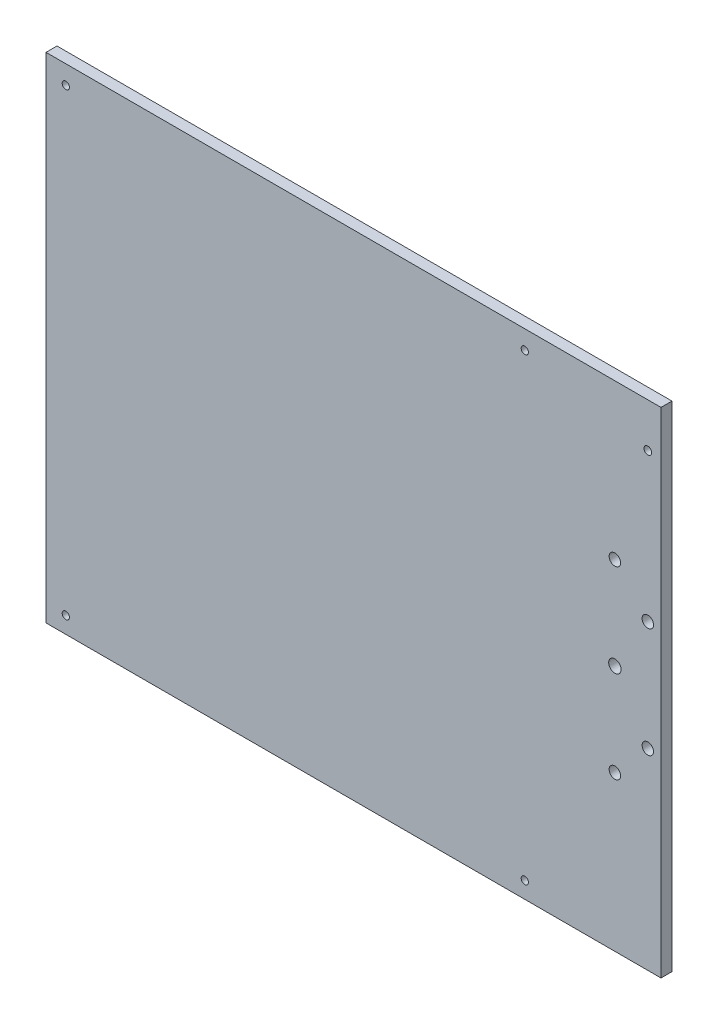
ISO-10303-21;
HEADER;
FILE_DESCRIPTION(('STEP AP214'),'2;1');
FILE_NAME('part.step','',(''),(''),'','','');
FILE_SCHEMA(('AUTOMOTIVE_DESIGN { 1 0 10303 214 1 1 1 1 }'));
ENDSEC;
DATA;
#1=APPLICATION_CONTEXT('core data for automotive mechanical design processes');
#2=APPLICATION_PROTOCOL_DEFINITION('international standard','automotive_design',2000,#1);
#3=PRODUCT_CONTEXT('',#1,'mechanical');
#4=PRODUCT('Part','Part','',(#3));
#5=PRODUCT_RELATED_PRODUCT_CATEGORY('part','',(#4));
#6=PRODUCT_DEFINITION_FORMATION('','',#4);
#7=PRODUCT_DEFINITION_CONTEXT('part definition',#1,'design');
#8=PRODUCT_DEFINITION('design','',#6,#7);
#9=PRODUCT_DEFINITION_SHAPE('','',#8);
#10=(LENGTH_UNIT() NAMED_UNIT(*) SI_UNIT(.MILLI.,.METRE.));
#11=(NAMED_UNIT(*) PLANE_ANGLE_UNIT() SI_UNIT($,.RADIAN.));
#12=(NAMED_UNIT(*) SI_UNIT($,.STERADIAN.) SOLID_ANGLE_UNIT());
#13=UNCERTAINTY_MEASURE_WITH_UNIT(LENGTH_MEASURE(1.E-05),#10,'distance_accuracy_value','');
#14=(GEOMETRIC_REPRESENTATION_CONTEXT(3) GLOBAL_UNCERTAINTY_ASSIGNED_CONTEXT((#13)) GLOBAL_UNIT_ASSIGNED_CONTEXT((#10,
#11,#12)) REPRESENTATION_CONTEXT('',''));
#15=CARTESIAN_POINT('',(0.,0.,0.));
#16=DIRECTION('',(0.,0.,1.));
#17=DIRECTION('',(1.,0.,0.));
#18=AXIS2_PLACEMENT_3D('',#15,#16,#17);
#19=CARTESIAN_POINT('',(0.,20.,5.));
#20=DIRECTION('',(-1.,0.,0.));
#21=DIRECTION('',(0.,0.,1.));
#22=AXIS2_PLACEMENT_3D('',#19,#20,#21);
#23=PLANE('',#22);
#24=DIRECTION('',(0.,1.,0.));
#25=VECTOR('',#24,1.);
#26=CARTESIAN_POINT('',(0.,20.,0.));
#27=LINE('',#26,#25);
#28=CARTESIAN_POINT('',(0.,20.,0.));
#29=VERTEX_POINT('',#28);
#30=CARTESIAN_POINT('',(0.,245.,0.));
#31=VERTEX_POINT('',#30);
#32=EDGE_CURVE('E97',#29,#31,#27,.T.);
#33=ORIENTED_EDGE('',*,*,#32,.T.);
#34=DIRECTION('',(0.,0.,-1.));
#35=VECTOR('',#34,1.);
#36=CARTESIAN_POINT('',(0.,245.,5.));
#37=LINE('',#36,#35);
#38=CARTESIAN_POINT('',(0.,245.,5.));
#39=VERTEX_POINT('',#38);
#40=EDGE_CURVE('E11',#39,#31,#37,.T.);
#41=ORIENTED_EDGE('',*,*,#40,.F.);
#42=DIRECTION('',(0.,1.,0.));
#43=VECTOR('',#42,1.);
#44=CARTESIAN_POINT('',(0.,20.,5.));
#45=LINE('',#44,#43);
#46=CARTESIAN_POINT('',(0.,20.,5.));
#47=VERTEX_POINT('',#46);
#48=EDGE_CURVE('E85',#47,#39,#45,.T.);
#49=ORIENTED_EDGE('',*,*,#48,.F.);
#50=DIRECTION('',(0.,0.,-1.));
#51=VECTOR('',#50,1.);
#52=CARTESIAN_POINT('',(0.,20.,5.));
#53=LINE('',#52,#51);
#54=EDGE_CURVE('E93',#47,#29,#53,.T.);
#55=ORIENTED_EDGE('',*,*,#54,.T.);
#56=EDGE_LOOP('',(#33,#41,#49,#55));
#57=FACE_BOUND('',#56,.T.);
#58=ADVANCED_FACE('F34',(#57),#23,.F.);
#59=CARTESIAN_POINT('',(0.,245.,5.));
#60=DIRECTION('',(0.,-1.,0.));
#61=DIRECTION('',(1.,0.,0.));
#62=AXIS2_PLACEMENT_3D('',#59,#60,#61);
#63=PLANE('',#62);
#64=DIRECTION('',(-1.,0.,0.));
#65=VECTOR('',#64,1.);
#66=CARTESIAN_POINT('',(0.,245.,0.));
#67=LINE('',#66,#65);
#68=CARTESIAN_POINT('',(-280.,245.,0.));
#69=VERTEX_POINT('',#68);
#70=EDGE_CURVE('E89',#31,#69,#67,.T.);
#71=ORIENTED_EDGE('',*,*,#70,.T.);
#72=DIRECTION('',(0.,0.,-1.));
#73=VECTOR('',#72,1.);
#74=CARTESIAN_POINT('',(-280.,245.,5.));
#75=LINE('',#74,#73);
#76=CARTESIAN_POINT('',(-280.,245.,5.));
#77=VERTEX_POINT('',#76);
#78=EDGE_CURVE('E42',#77,#69,#75,.T.);
#79=ORIENTED_EDGE('',*,*,#78,.F.);
#80=DIRECTION('',(-1.,0.,0.));
#81=VECTOR('',#80,1.);
#82=CARTESIAN_POINT('',(0.,245.,5.));
#83=LINE('',#82,#81);
#84=EDGE_CURVE('E80',#39,#77,#83,.T.);
#85=ORIENTED_EDGE('',*,*,#84,.F.);
#86=ORIENTED_EDGE('',*,*,#40,.T.);
#87=EDGE_LOOP('',(#71,#79,#85,#86));
#88=FACE_BOUND('',#87,.T.);
#89=ADVANCED_FACE('F88',(#88),#63,.F.);
#90=CARTESIAN_POINT('',(-280.,20.,5.));
#91=DIRECTION('',(1.,0.,0.));
#92=DIRECTION('',(0.,0.,-1.));
#93=AXIS2_PLACEMENT_3D('',#90,#91,#92);
#94=PLANE('',#93);
#95=DIRECTION('',(0.,-1.,0.));
#96=VECTOR('',#95,1.);
#97=CARTESIAN_POINT('',(-280.,20.,0.));
#98=LINE('',#97,#96);
#99=CARTESIAN_POINT('',(-280.,20.,0.));
#100=VERTEX_POINT('',#99);
#101=EDGE_CURVE('E67',#69,#100,#98,.T.);
#102=ORIENTED_EDGE('',*,*,#101,.T.);
#103=DIRECTION('',(0.,0.,-1.));
#104=VECTOR('',#103,1.);
#105=CARTESIAN_POINT('',(-280.,20.,5.));
#106=LINE('',#105,#104);
#107=CARTESIAN_POINT('',(-280.,20.,5.));
#108=VERTEX_POINT('',#107);
#109=EDGE_CURVE('E90',#108,#100,#106,.T.);
#110=ORIENTED_EDGE('',*,*,#109,.F.);
#111=DIRECTION('',(0.,-1.,0.));
#112=VECTOR('',#111,1.);
#113=CARTESIAN_POINT('',(-280.,20.,5.));
#114=LINE('',#113,#112);
#115=EDGE_CURVE('E83',#77,#108,#114,.T.);
#116=ORIENTED_EDGE('',*,*,#115,.F.);
#117=ORIENTED_EDGE('',*,*,#78,.T.);
#118=EDGE_LOOP('',(#102,#110,#116,#117));
#119=FACE_BOUND('',#118,.T.);
#120=ADVANCED_FACE('F91',(#119),#94,.F.);
#121=CARTESIAN_POINT('',(0.,20.,5.));
#122=DIRECTION('',(0.,1.,0.));
#123=DIRECTION('',(-1.,0.,0.));
#124=AXIS2_PLACEMENT_3D('',#121,#122,#123);
#125=PLANE('',#124);
#126=DIRECTION('',(1.,0.,0.));
#127=VECTOR('',#126,1.);
#128=CARTESIAN_POINT('',(0.,20.,0.));
#129=LINE('',#128,#127);
#130=EDGE_CURVE('E73',#100,#29,#129,.T.);
#131=ORIENTED_EDGE('',*,*,#130,.T.);
#132=ORIENTED_EDGE('',*,*,#54,.F.);
#133=DIRECTION('',(1.,0.,0.));
#134=VECTOR('',#133,1.);
#135=CARTESIAN_POINT('',(0.,20.,5.));
#136=LINE('',#135,#134);
#137=EDGE_CURVE('E50',#108,#47,#136,.T.);
#138=ORIENTED_EDGE('',*,*,#137,.F.);
#139=ORIENTED_EDGE('',*,*,#109,.T.);
#140=EDGE_LOOP('',(#131,#132,#138,#139));
#141=FACE_BOUND('',#140,.T.);
#142=ADVANCED_FACE('F105',(#141),#125,.F.);
#143=CARTESIAN_POINT('',(0.,0.,5.));
#144=DIRECTION('',(0.,0.,1.));
#145=DIRECTION('',(1.,0.,0.));
#146=AXIS2_PLACEMENT_3D('',#143,#144,#145);
#147=PLANE('',#146);
#148=CARTESIAN_POINT('',(-6.,225.,5.));
#149=DIRECTION('',(0.,0.,1.));
#150=DIRECTION('',(1.,0.,0.));
#151=AXIS2_PLACEMENT_3D('',#148,#149,#150);
#152=CIRCLE('',#151,1.75);
#153=CARTESIAN_POINT('',(-4.25,225.,5.));
#154=VERTEX_POINT('',#153);
#155=EDGE_CURVE('E164',#154,#154,#152,.T.);
#156=ORIENTED_EDGE('',*,*,#155,.F.);
#157=EDGE_LOOP('',(#156));
#158=FACE_BOUND('',#157,.T.);
#159=CARTESIAN_POINT('',(-21.,174.5,5.));
#160=DIRECTION('',(0.,0.,1.));
#161=DIRECTION('',(1.,0.,0.));
#162=AXIS2_PLACEMENT_3D('',#159,#160,#161);
#163=CIRCLE('',#162,2.6);
#164=CARTESIAN_POINT('',(-18.4,174.5,5.));
#165=VERTEX_POINT('',#164);
#166=EDGE_CURVE('E158',#165,#165,#163,.T.);
#167=ORIENTED_EDGE('',*,*,#166,.F.);
#168=EDGE_LOOP('',(#167));
#169=FACE_BOUND('',#168,.T.);
#170=CARTESIAN_POINT('',(-21.,132.5,5.));
#171=DIRECTION('',(0.,0.,1.));
#172=DIRECTION('',(1.,0.,0.));
#173=AXIS2_PLACEMENT_3D('',#170,#171,#172);
#174=CIRCLE('',#173,2.83064044469154);
#175=CARTESIAN_POINT('',(-18.1693595553085,132.5,5.));
#176=VERTEX_POINT('',#175);
#177=EDGE_CURVE('E152',#176,#176,#174,.T.);
#178=ORIENTED_EDGE('',*,*,#177,.F.);
#179=EDGE_LOOP('',(#178));
#180=FACE_BOUND('',#179,.T.);
#181=CARTESIAN_POINT('',(-21.,90.5,5.));
#182=DIRECTION('',(0.,0.,1.));
#183=DIRECTION('',(1.,0.,0.));
#184=AXIS2_PLACEMENT_3D('',#181,#182,#183);
#185=CIRCLE('',#184,2.60000000000001);
#186=CARTESIAN_POINT('',(-18.4,90.5,5.));
#187=VERTEX_POINT('',#186);
#188=EDGE_CURVE('E146',#187,#187,#185,.T.);
#189=ORIENTED_EDGE('',*,*,#188,.F.);
#190=EDGE_LOOP('',(#189));
#191=FACE_BOUND('',#190,.T.);
#192=CARTESIAN_POINT('',(-6.,157.5,5.));
#193=DIRECTION('',(0.,0.,1.));
#194=DIRECTION('',(1.,0.,0.));
#195=AXIS2_PLACEMENT_3D('',#192,#193,#194);
#196=CIRCLE('',#195,2.59999999999999);
#197=CARTESIAN_POINT('',(-3.40000000000001,157.5,5.));
#198=VERTEX_POINT('',#197);
#199=EDGE_CURVE('E140',#198,#198,#196,.T.);
#200=ORIENTED_EDGE('',*,*,#199,.F.);
#201=EDGE_LOOP('',(#200));
#202=FACE_BOUND('',#201,.T.);
#203=CARTESIAN_POINT('',(-6.,107.5,5.));
#204=DIRECTION('',(0.,0.,1.));
#205=DIRECTION('',(1.,0.,0.));
#206=AXIS2_PLACEMENT_3D('',#203,#204,#205);
#207=CIRCLE('',#206,2.6);
#208=CARTESIAN_POINT('',(-3.4,107.5,5.));
#209=VERTEX_POINT('',#208);
#210=EDGE_CURVE('E134',#209,#209,#207,.T.);
#211=ORIENTED_EDGE('',*,*,#210,.F.);
#212=EDGE_LOOP('',(#211));
#213=FACE_BOUND('',#212,.T.);
#214=CARTESIAN_POINT('',(-271.,27.5000000000032,5.));
#215=DIRECTION('',(0.,0.,1.));
#216=DIRECTION('',(1.,0.,0.));
#217=AXIS2_PLACEMENT_3D('',#214,#215,#216);
#218=CIRCLE('',#217,1.64999999999998);
#219=CARTESIAN_POINT('',(-269.35,27.5000000000032,5.));
#220=VERTEX_POINT('',#219);
#221=EDGE_CURVE('E128',#220,#220,#218,.T.);
#222=ORIENTED_EDGE('',*,*,#221,.F.);
#223=EDGE_LOOP('',(#222));
#224=FACE_BOUND('',#223,.T.);
#225=CARTESIAN_POINT('',(-62.,27.5000000000032,5.));
#226=DIRECTION('',(0.,0.,1.));
#227=DIRECTION('',(1.,0.,0.));
#228=AXIS2_PLACEMENT_3D('',#225,#226,#227);
#229=CIRCLE('',#228,1.64999999999999);
#230=CARTESIAN_POINT('',(-60.35,27.5000000000032,5.));
#231=VERTEX_POINT('',#230);
#232=EDGE_CURVE('E122',#231,#231,#229,.T.);
#233=ORIENTED_EDGE('',*,*,#232,.F.);
#234=EDGE_LOOP('',(#233));
#235=FACE_BOUND('',#234,.T.);
#236=CARTESIAN_POINT('',(-271.,236.500000000003,5.));
#237=DIRECTION('',(0.,0.,1.));
#238=DIRECTION('',(1.,0.,0.));
#239=AXIS2_PLACEMENT_3D('',#236,#237,#238);
#240=CIRCLE('',#239,1.64999999999998);
#241=CARTESIAN_POINT('',(-269.35,236.500000000003,5.));
#242=VERTEX_POINT('',#241);
#243=EDGE_CURVE('E116',#242,#242,#240,.T.);
#244=ORIENTED_EDGE('',*,*,#243,.F.);
#245=EDGE_LOOP('',(#244));
#246=FACE_BOUND('',#245,.T.);
#247=CARTESIAN_POINT('',(-62.,236.500000000003,5.));
#248=DIRECTION('',(0.,0.,1.));
#249=DIRECTION('',(1.,0.,0.));
#250=AXIS2_PLACEMENT_3D('',#247,#248,#249);
#251=CIRCLE('',#250,1.64999999999999);
#252=CARTESIAN_POINT('',(-60.35,236.500000000003,5.));
#253=VERTEX_POINT('',#252);
#254=EDGE_CURVE('E100',#253,#253,#251,.T.);
#255=ORIENTED_EDGE('',*,*,#254,.F.);
#256=EDGE_LOOP('',(#255));
#257=FACE_BOUND('',#256,.T.);
#258=ORIENTED_EDGE('',*,*,#48,.T.);
#259=ORIENTED_EDGE('',*,*,#84,.T.);
#260=ORIENTED_EDGE('',*,*,#115,.T.);
#261=ORIENTED_EDGE('',*,*,#137,.T.);
#262=EDGE_LOOP('',(#258,#259,#260,#261));
#263=FACE_BOUND('',#262,.T.);
#264=ADVANCED_FACE('F81',(#158,#169,#180,#191,#202,#213,#224,#235,#246,#257,#263),#147,.T.);
#265=CARTESIAN_POINT('',(0.,0.,0.));
#266=DIRECTION('',(0.,0.,1.));
#267=DIRECTION('',(1.,0.,0.));
#268=AXIS2_PLACEMENT_3D('',#265,#266,#267);
#269=PLANE('',#268);
#270=CARTESIAN_POINT('',(-6.,225.,0.));
#271=DIRECTION('',(0.,0.,-1.));
#272=DIRECTION('',(-1.,0.,0.));
#273=AXIS2_PLACEMENT_3D('',#270,#271,#272);
#274=CIRCLE('',#273,1.75);
#275=CARTESIAN_POINT('',(-7.75,225.,0.));
#276=VERTEX_POINT('',#275);
#277=EDGE_CURVE('E167',#276,#276,#274,.T.);
#278=ORIENTED_EDGE('',*,*,#277,.F.);
#279=EDGE_LOOP('',(#278));
#280=FACE_BOUND('',#279,.T.);
#281=CARTESIAN_POINT('',(-21.,174.5,0.));
#282=DIRECTION('',(0.,0.,-1.));
#283=DIRECTION('',(-1.,0.,0.));
#284=AXIS2_PLACEMENT_3D('',#281,#282,#283);
#285=CIRCLE('',#284,2.6);
#286=CARTESIAN_POINT('',(-23.6,174.5,0.));
#287=VERTEX_POINT('',#286);
#288=EDGE_CURVE('E161',#287,#287,#285,.T.);
#289=ORIENTED_EDGE('',*,*,#288,.F.);
#290=EDGE_LOOP('',(#289));
#291=FACE_BOUND('',#290,.T.);
#292=CARTESIAN_POINT('',(-21.,132.5,0.));
#293=DIRECTION('',(0.,0.,-1.));
#294=DIRECTION('',(-1.,0.,0.));
#295=AXIS2_PLACEMENT_3D('',#292,#293,#294);
#296=CIRCLE('',#295,2.83064044469154);
#297=CARTESIAN_POINT('',(-23.8306404446915,132.5,0.));
#298=VERTEX_POINT('',#297);
#299=EDGE_CURVE('E155',#298,#298,#296,.T.);
#300=ORIENTED_EDGE('',*,*,#299,.F.);
#301=EDGE_LOOP('',(#300));
#302=FACE_BOUND('',#301,.T.);
#303=CARTESIAN_POINT('',(-21.,90.5,0.));
#304=DIRECTION('',(0.,0.,-1.));
#305=DIRECTION('',(-1.,0.,0.));
#306=AXIS2_PLACEMENT_3D('',#303,#304,#305);
#307=CIRCLE('',#306,2.60000000000001);
#308=CARTESIAN_POINT('',(-23.6,90.5,0.));
#309=VERTEX_POINT('',#308);
#310=EDGE_CURVE('E149',#309,#309,#307,.T.);
#311=ORIENTED_EDGE('',*,*,#310,.F.);
#312=EDGE_LOOP('',(#311));
#313=FACE_BOUND('',#312,.T.);
#314=CARTESIAN_POINT('',(-6.,157.5,0.));
#315=DIRECTION('',(0.,0.,-1.));
#316=DIRECTION('',(-1.,0.,0.));
#317=AXIS2_PLACEMENT_3D('',#314,#315,#316);
#318=CIRCLE('',#317,2.59999999999999);
#319=CARTESIAN_POINT('',(-8.59999999999999,157.5,0.));
#320=VERTEX_POINT('',#319);
#321=EDGE_CURVE('E143',#320,#320,#318,.T.);
#322=ORIENTED_EDGE('',*,*,#321,.F.);
#323=EDGE_LOOP('',(#322));
#324=FACE_BOUND('',#323,.T.);
#325=CARTESIAN_POINT('',(-6.,107.5,0.));
#326=DIRECTION('',(0.,0.,-1.));
#327=DIRECTION('',(-1.,0.,0.));
#328=AXIS2_PLACEMENT_3D('',#325,#326,#327);
#329=CIRCLE('',#328,2.6);
#330=CARTESIAN_POINT('',(-8.6,107.5,0.));
#331=VERTEX_POINT('',#330);
#332=EDGE_CURVE('E137',#331,#331,#329,.T.);
#333=ORIENTED_EDGE('',*,*,#332,.F.);
#334=EDGE_LOOP('',(#333));
#335=FACE_BOUND('',#334,.T.);
#336=CARTESIAN_POINT('',(-271.,27.5000000000032,0.));
#337=DIRECTION('',(0.,0.,-1.));
#338=DIRECTION('',(-1.,0.,0.));
#339=AXIS2_PLACEMENT_3D('',#336,#337,#338);
#340=CIRCLE('',#339,1.64999999999998);
#341=CARTESIAN_POINT('',(-272.65,27.5000000000032,0.));
#342=VERTEX_POINT('',#341);
#343=EDGE_CURVE('E131',#342,#342,#340,.T.);
#344=ORIENTED_EDGE('',*,*,#343,.F.);
#345=EDGE_LOOP('',(#344));
#346=FACE_BOUND('',#345,.T.);
#347=CARTESIAN_POINT('',(-62.,27.5000000000032,0.));
#348=DIRECTION('',(0.,0.,-1.));
#349=DIRECTION('',(-1.,0.,0.));
#350=AXIS2_PLACEMENT_3D('',#347,#348,#349);
#351=CIRCLE('',#350,1.64999999999998);
#352=CARTESIAN_POINT('',(-63.65,27.5000000000032,0.));
#353=VERTEX_POINT('',#352);
#354=EDGE_CURVE('E125',#353,#353,#351,.T.);
#355=ORIENTED_EDGE('',*,*,#354,.F.);
#356=EDGE_LOOP('',(#355));
#357=FACE_BOUND('',#356,.T.);
#358=CARTESIAN_POINT('',(-271.,236.500000000003,0.));
#359=DIRECTION('',(0.,0.,-1.));
#360=DIRECTION('',(-1.,0.,0.));
#361=AXIS2_PLACEMENT_3D('',#358,#359,#360);
#362=CIRCLE('',#361,1.64999999999998);
#363=CARTESIAN_POINT('',(-272.65,236.500000000003,0.));
#364=VERTEX_POINT('',#363);
#365=EDGE_CURVE('E119',#364,#364,#362,.T.);
#366=ORIENTED_EDGE('',*,*,#365,.F.);
#367=EDGE_LOOP('',(#366));
#368=FACE_BOUND('',#367,.T.);
#369=CARTESIAN_POINT('',(-62.,236.500000000003,0.));
#370=DIRECTION('',(0.,0.,-1.));
#371=DIRECTION('',(-1.,0.,0.));
#372=AXIS2_PLACEMENT_3D('',#369,#370,#371);
#373=CIRCLE('',#372,1.64999999999998);
#374=CARTESIAN_POINT('',(-63.65,236.500000000003,0.));
#375=VERTEX_POINT('',#374);
#376=EDGE_CURVE('E113',#375,#375,#373,.T.);
#377=ORIENTED_EDGE('',*,*,#376,.F.);
#378=EDGE_LOOP('',(#377));
#379=FACE_BOUND('',#378,.T.);
#380=ORIENTED_EDGE('',*,*,#32,.F.);
#381=ORIENTED_EDGE('',*,*,#130,.F.);
#382=ORIENTED_EDGE('',*,*,#101,.F.);
#383=ORIENTED_EDGE('',*,*,#70,.F.);
#384=EDGE_LOOP('',(#380,#381,#382,#383));
#385=FACE_BOUND('',#384,.T.);
#386=ADVANCED_FACE('F108',(#280,#291,#302,#313,#324,#335,#346,#357,#368,#379,#385),#269,.F.);
#387=CARTESIAN_POINT('',(-62.,236.500000000003,0.));
#388=DIRECTION('',(0.,0.,-1.));
#389=DIRECTION('',(-1.,0.,0.));
#390=AXIS2_PLACEMENT_3D('',#387,#388,#389);
#391=CYLINDRICAL_SURFACE('',#390,1.64999999999999);
#392=ORIENTED_EDGE('',*,*,#376,.T.);
#393=EDGE_LOOP('',(#392));
#394=FACE_BOUND('',#393,.T.);
#395=ORIENTED_EDGE('',*,*,#254,.T.);
#396=EDGE_LOOP('',(#395));
#397=FACE_BOUND('',#396,.T.);
#398=ADVANCED_FACE('F175',(#394,#397),#391,.F.);
#399=CARTESIAN_POINT('',(-271.,236.500000000003,0.));
#400=DIRECTION('',(0.,0.,-1.));
#401=DIRECTION('',(-1.,0.,0.));
#402=AXIS2_PLACEMENT_3D('',#399,#400,#401);
#403=CYLINDRICAL_SURFACE('',#402,1.64999999999998);
#404=ORIENTED_EDGE('',*,*,#365,.T.);
#405=EDGE_LOOP('',(#404));
#406=FACE_BOUND('',#405,.T.);
#407=ORIENTED_EDGE('',*,*,#243,.T.);
#408=EDGE_LOOP('',(#407));
#409=FACE_BOUND('',#408,.T.);
#410=ADVANCED_FACE('F197',(#406,#409),#403,.F.);
#411=CARTESIAN_POINT('',(-62.,27.5000000000032,0.));
#412=DIRECTION('',(0.,0.,-1.));
#413=DIRECTION('',(-1.,0.,0.));
#414=AXIS2_PLACEMENT_3D('',#411,#412,#413);
#415=CYLINDRICAL_SURFACE('',#414,1.64999999999999);
#416=ORIENTED_EDGE('',*,*,#354,.T.);
#417=EDGE_LOOP('',(#416));
#418=FACE_BOUND('',#417,.T.);
#419=ORIENTED_EDGE('',*,*,#232,.T.);
#420=EDGE_LOOP('',(#419));
#421=FACE_BOUND('',#420,.T.);
#422=ADVANCED_FACE('F243',(#418,#421),#415,.F.);
#423=CARTESIAN_POINT('',(-271.,27.5000000000032,0.));
#424=DIRECTION('',(0.,0.,-1.));
#425=DIRECTION('',(-1.,0.,0.));
#426=AXIS2_PLACEMENT_3D('',#423,#424,#425);
#427=CYLINDRICAL_SURFACE('',#426,1.64999999999998);
#428=ORIENTED_EDGE('',*,*,#343,.T.);
#429=EDGE_LOOP('',(#428));
#430=FACE_BOUND('',#429,.T.);
#431=ORIENTED_EDGE('',*,*,#221,.T.);
#432=EDGE_LOOP('',(#431));
#433=FACE_BOUND('',#432,.T.);
#434=ADVANCED_FACE('F254',(#430,#433),#427,.F.);
#435=CARTESIAN_POINT('',(-6.,107.5,10.));
#436=DIRECTION('',(0.,0.,-1.));
#437=DIRECTION('',(-1.,0.,0.));
#438=AXIS2_PLACEMENT_3D('',#435,#436,#437);
#439=CYLINDRICAL_SURFACE('',#438,2.6);
#440=ORIENTED_EDGE('',*,*,#210,.T.);
#441=EDGE_LOOP('',(#440));
#442=FACE_BOUND('',#441,.T.);
#443=ORIENTED_EDGE('',*,*,#332,.T.);
#444=EDGE_LOOP('',(#443));
#445=FACE_BOUND('',#444,.T.);
#446=ADVANCED_FACE('F264',(#442,#445),#439,.F.);
#447=CARTESIAN_POINT('',(-6.,157.5,10.));
#448=DIRECTION('',(0.,0.,-1.));
#449=DIRECTION('',(-1.,0.,0.));
#450=AXIS2_PLACEMENT_3D('',#447,#448,#449);
#451=CYLINDRICAL_SURFACE('',#450,2.59999999999999);
#452=ORIENTED_EDGE('',*,*,#199,.T.);
#453=EDGE_LOOP('',(#452));
#454=FACE_BOUND('',#453,.T.);
#455=ORIENTED_EDGE('',*,*,#321,.T.);
#456=EDGE_LOOP('',(#455));
#457=FACE_BOUND('',#456,.T.);
#458=ADVANCED_FACE('F284',(#454,#457),#451,.F.);
#459=CARTESIAN_POINT('',(-21.,90.5,10.));
#460=DIRECTION('',(0.,0.,-1.));
#461=DIRECTION('',(-1.,0.,0.));
#462=AXIS2_PLACEMENT_3D('',#459,#460,#461);
#463=CYLINDRICAL_SURFACE('',#462,2.60000000000001);
#464=ORIENTED_EDGE('',*,*,#188,.T.);
#465=EDGE_LOOP('',(#464));
#466=FACE_BOUND('',#465,.T.);
#467=ORIENTED_EDGE('',*,*,#310,.T.);
#468=EDGE_LOOP('',(#467));
#469=FACE_BOUND('',#468,.T.);
#470=ADVANCED_FACE('F294',(#466,#469),#463,.F.);
#471=CARTESIAN_POINT('',(-21.,132.5,10.));
#472=DIRECTION('',(0.,0.,-1.));
#473=DIRECTION('',(-1.,0.,0.));
#474=AXIS2_PLACEMENT_3D('',#471,#472,#473);
#475=CYLINDRICAL_SURFACE('',#474,2.83064044469154);
#476=ORIENTED_EDGE('',*,*,#177,.T.);
#477=EDGE_LOOP('',(#476));
#478=FACE_BOUND('',#477,.T.);
#479=ORIENTED_EDGE('',*,*,#299,.T.);
#480=EDGE_LOOP('',(#479));
#481=FACE_BOUND('',#480,.T.);
#482=ADVANCED_FACE('F304',(#478,#481),#475,.F.);
#483=CARTESIAN_POINT('',(-21.,174.5,10.));
#484=DIRECTION('',(0.,0.,-1.));
#485=DIRECTION('',(-1.,0.,0.));
#486=AXIS2_PLACEMENT_3D('',#483,#484,#485);
#487=CYLINDRICAL_SURFACE('',#486,2.6);
#488=ORIENTED_EDGE('',*,*,#166,.T.);
#489=EDGE_LOOP('',(#488));
#490=FACE_BOUND('',#489,.T.);
#491=ORIENTED_EDGE('',*,*,#288,.T.);
#492=EDGE_LOOP('',(#491));
#493=FACE_BOUND('',#492,.T.);
#494=ADVANCED_FACE('F314',(#490,#493),#487,.F.);
#495=CARTESIAN_POINT('',(-6.,225.,10.));
#496=DIRECTION('',(0.,0.,-1.));
#497=DIRECTION('',(-1.,0.,0.));
#498=AXIS2_PLACEMENT_3D('',#495,#496,#497);
#499=CYLINDRICAL_SURFACE('',#498,1.75);
#500=ORIENTED_EDGE('',*,*,#155,.T.);
#501=EDGE_LOOP('',(#500));
#502=FACE_BOUND('',#501,.T.);
#503=ORIENTED_EDGE('',*,*,#277,.T.);
#504=EDGE_LOOP('',(#503));
#505=FACE_BOUND('',#504,.T.);
#506=ADVANCED_FACE('F171',(#502,#505),#499,.F.);
#507=CLOSED_SHELL('',(#58,#89,#120,#142,#264,#386,#398,#410,#422,#434,#446,#458,#470,#482,#494,#506));
#508=MANIFOLD_SOLID_BREP('B2',#507);
#509=ADVANCED_BREP_SHAPE_REPRESENTATION('',(#18,#508),#14);
#510=SHAPE_DEFINITION_REPRESENTATION(#9,#509);
ENDSEC;
END-ISO-10303-21;
